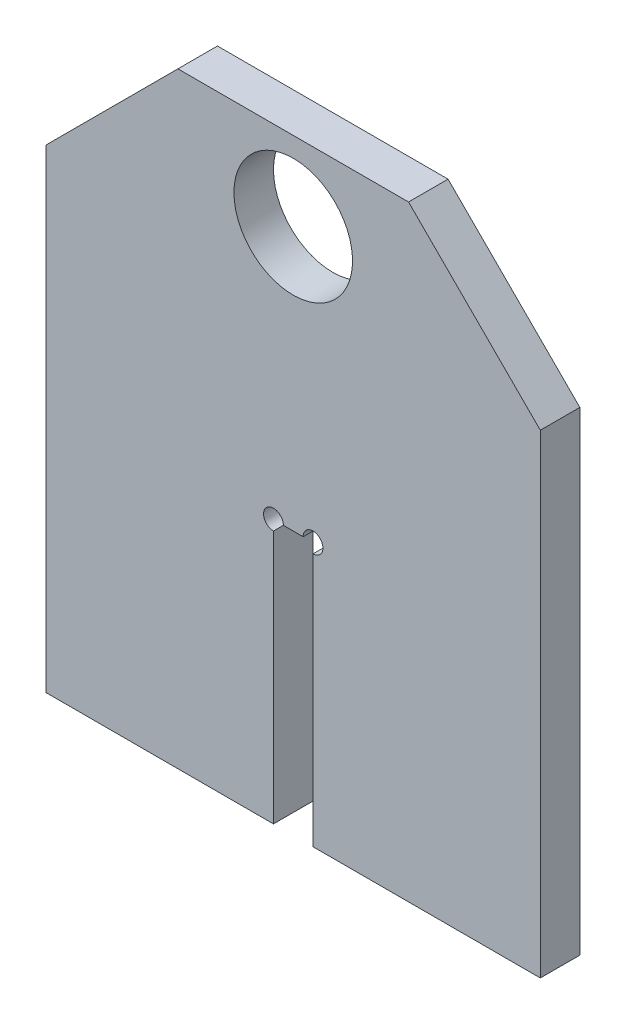
ISO-10303-21;
HEADER;
FILE_DESCRIPTION(('STEP AP214'),'2;1');
FILE_NAME('part.step','',(''),(''),'','','');
FILE_SCHEMA(('AUTOMOTIVE_DESIGN { 1 0 10303 214 1 1 1 1 }'));
ENDSEC;
DATA;
#1=APPLICATION_CONTEXT('core data for automotive mechanical design processes');
#2=APPLICATION_PROTOCOL_DEFINITION('international standard','automotive_design',2000,#1);
#3=PRODUCT_CONTEXT('',#1,'mechanical');
#4=PRODUCT('Part','Part','',(#3));
#5=PRODUCT_RELATED_PRODUCT_CATEGORY('part','',(#4));
#6=PRODUCT_DEFINITION_FORMATION('','',#4);
#7=PRODUCT_DEFINITION_CONTEXT('part definition',#1,'design');
#8=PRODUCT_DEFINITION('design','',#6,#7);
#9=PRODUCT_DEFINITION_SHAPE('','',#8);
#10=(LENGTH_UNIT() NAMED_UNIT(*) SI_UNIT(.MILLI.,.METRE.));
#11=(NAMED_UNIT(*) PLANE_ANGLE_UNIT() SI_UNIT($,.RADIAN.));
#12=(NAMED_UNIT(*) SI_UNIT($,.STERADIAN.) SOLID_ANGLE_UNIT());
#13=UNCERTAINTY_MEASURE_WITH_UNIT(LENGTH_MEASURE(1.E-05),#10,'distance_accuracy_value','');
#14=(GEOMETRIC_REPRESENTATION_CONTEXT(3) GLOBAL_UNCERTAINTY_ASSIGNED_CONTEXT((#13)) GLOBAL_UNIT_ASSIGNED_CONTEXT((#10,
#11,#12)) REPRESENTATION_CONTEXT('',''));
#15=CARTESIAN_POINT('',(0.,0.,0.));
#16=DIRECTION('',(0.,0.,1.));
#17=DIRECTION('',(1.,0.,0.));
#18=AXIS2_PLACEMENT_3D('',#15,#16,#17);
#19=CARTESIAN_POINT('',(9.64995892933224E-05,239.99993796999,124.697113534619));
#20=DIRECTION('',(0.,0.,-1.00000000000002));
#21=DIRECTION('',(-0.999999999999985,0.,0.));
#22=AXIS2_PLACEMENT_3D('',#19,#20,#21);
#23=CYLINDRICAL_SURFACE('',#22,9.00000000000002);
#24=CARTESIAN_POINT('',(9.64995893713849E-05,239.99993796999,5.99999999999998));
#25=DIRECTION('',(0.,0.,-1.00000000000001));
#26=DIRECTION('',(-0.999999999999985,0.,0.));
#27=AXIS2_PLACEMENT_3D('',#24,#25,#26);
#28=CIRCLE('',#27,9.00000000000002);
#29=CARTESIAN_POINT('',(-8.99990350041051,239.99993796999,5.99999999999998));
#30=VERTEX_POINT('',#29);
#31=EDGE_CURVE('E11',#30,#30,#28,.T.);
#32=ORIENTED_EDGE('',*,*,#31,.F.);
#33=EDGE_LOOP('',(#32));
#34=FACE_BOUND('',#33,.T.);
#35=CARTESIAN_POINT('',(9.64995893609766E-05,239.99993796999,0.));
#36=DIRECTION('',(0.,0.,1.00000000000002));
#37=DIRECTION('',(0.999999999999985,0.,0.));
#38=AXIS2_PLACEMENT_3D('',#35,#36,#37);
#39=CIRCLE('',#38,9.00000000000002);
#40=CARTESIAN_POINT('',(9.00009649958924,239.99993796999,0.));
#41=VERTEX_POINT('',#40);
#42=EDGE_CURVE('E157',#41,#41,#39,.T.);
#43=ORIENTED_EDGE('',*,*,#42,.F.);
#44=EDGE_LOOP('',(#43));
#45=FACE_BOUND('',#44,.T.);
#46=ADVANCED_FACE('F38',(#34,#45),#23,.F.);
#47=CARTESIAN_POINT('',(0.,0.,0.));
#48=DIRECTION('',(0.,0.,1.00000000000002));
#49=DIRECTION('',(0.999999999999985,0.,0.));
#50=AXIS2_PLACEMENT_3D('',#47,#48,#49);
#51=PLANE('',#50);
#52=ORIENTED_EDGE('',*,*,#42,.T.);
#53=EDGE_LOOP('',(#52));
#54=FACE_BOUND('',#53,.T.);
#55=CARTESIAN_POINT('',(3.00000000001347,200.,0.));
#56=DIRECTION('',(0.,0.,1.00000000000002));
#57=DIRECTION('',(0.999999999999985,0.,0.));
#58=AXIS2_PLACEMENT_3D('',#55,#56,#57);
#59=CIRCLE('',#58,1.5);
#60=CARTESIAN_POINT('',(3.00000000001348,198.5,0.));
#61=VERTEX_POINT('',#60);
#62=CARTESIAN_POINT('',(1.50000000001349,200.,0.));
#63=VERTEX_POINT('',#62);
#64=EDGE_CURVE('E146',#61,#63,#59,.T.);
#65=ORIENTED_EDGE('',*,*,#64,.T.);
#66=DIRECTION('',(0.999999999999985,0.,0.));
#67=VECTOR('',#66,1.);
#68=CARTESIAN_POINT('',(0.,200.,0.));
#69=LINE('',#68,#67);
#70=CARTESIAN_POINT('',(-1.49999999998635,200.,0.));
#71=VERTEX_POINT('',#70);
#72=EDGE_CURVE('E197',#71,#63,#69,.T.);
#73=ORIENTED_EDGE('',*,*,#72,.F.);
#74=CARTESIAN_POINT('',(-2.99999999998636,200.,0.));
#75=DIRECTION('',(0.,0.,1.00000000000002));
#76=DIRECTION('',(0.999999999999985,0.,0.));
#77=AXIS2_PLACEMENT_3D('',#74,#75,#76);
#78=CIRCLE('',#77,1.5);
#79=CARTESIAN_POINT('',(-2.99999999998638,198.5,0.));
#80=VERTEX_POINT('',#79);
#81=EDGE_CURVE('E193',#71,#80,#78,.T.);
#82=ORIENTED_EDGE('',*,*,#81,.T.);
#83=DIRECTION('',(0.,1.,0.));
#84=VECTOR('',#83,1.);
#85=CARTESIAN_POINT('',(-2.99999999998752,0.,0.));
#86=LINE('',#85,#84);
#87=CARTESIAN_POINT('',(-2.99999999998662,160.,0.));
#88=VERTEX_POINT('',#87);
#89=EDGE_CURVE('E189',#88,#80,#86,.T.);
#90=ORIENTED_EDGE('',*,*,#89,.F.);
#91=DIRECTION('',(0.999999999999985,0.,0.));
#92=VECTOR('',#91,1.);
#93=CARTESIAN_POINT('',(-1.35308431126191E-13,160.,0.));
#94=LINE('',#93,#92);
#95=CARTESIAN_POINT('',(-37.4999999999995,160.,0.));
#96=VERTEX_POINT('',#95);
#97=EDGE_CURVE('E185',#96,#88,#94,.T.);
#98=ORIENTED_EDGE('',*,*,#97,.F.);
#99=DIRECTION('',(0.,1.,0.));
#100=VECTOR('',#99,1.);
#101=CARTESIAN_POINT('',(-37.4999999999995,0.,0.));
#102=LINE('',#101,#100);
#103=CARTESIAN_POINT('',(-37.4999999999994,232.000025877441,0.));
#104=VERTEX_POINT('',#103);
#105=EDGE_CURVE('E182',#96,#104,#102,.T.);
#106=ORIENTED_EDGE('',*,*,#105,.T.);
#107=DIRECTION('',(-0.707106781186536,-0.707106781186547,0.));
#108=VECTOR('',#107,1.);
#109=CARTESIAN_POINT('',(-134.750012938718,134.750012938724,2.56739074444567E-13));
#110=LINE('',#109,#108);
#111=CARTESIAN_POINT('',(-17.4999999999997,252.000025877441,0.));
#112=VERTEX_POINT('',#111);
#113=EDGE_CURVE('E178',#112,#104,#110,.T.);
#114=ORIENTED_EDGE('',*,*,#113,.F.);
#115=DIRECTION('',(-0.999999999999985,0.,0.));
#116=VECTOR('',#115,1.);
#117=CARTESIAN_POINT('',(0.,252.000025877441,0.));
#118=LINE('',#117,#116);
#119=CARTESIAN_POINT('',(17.4999999999997,252.000025877441,0.));
#120=VERTEX_POINT('',#119);
#121=EDGE_CURVE('E174',#120,#112,#118,.T.);
#122=ORIENTED_EDGE('',*,*,#121,.F.);
#123=DIRECTION('',(-0.707106781186539,0.707106781186547,0.));
#124=VECTOR('',#123,1.);
#125=CARTESIAN_POINT('',(134.750012938719,134.750012938718,-1.04083408558608E-13));
#126=LINE('',#125,#124);
#127=CARTESIAN_POINT('',(37.4999999999995,232.000025877441,0.));
#128=VERTEX_POINT('',#127);
#129=EDGE_CURVE('E170',#128,#120,#126,.T.);
#130=ORIENTED_EDGE('',*,*,#129,.F.);
#131=DIRECTION('',(0.,1.,0.));
#132=VECTOR('',#131,1.);
#133=CARTESIAN_POINT('',(37.4999999999993,0.,0.));
#134=LINE('',#133,#132);
#135=CARTESIAN_POINT('',(37.4999999999993,160.,0.));
#136=VERTEX_POINT('',#135);
#137=EDGE_CURVE('E166',#136,#128,#134,.T.);
#138=ORIENTED_EDGE('',*,*,#137,.F.);
#139=DIRECTION('',(0.999999999999985,0.,0.));
#140=VECTOR('',#139,1.);
#141=CARTESIAN_POINT('',(1.30104260698261E-13,160.,0.));
#142=LINE('',#141,#140);
#143=CARTESIAN_POINT('',(3.00000000001333,160.,0.));
#144=VERTEX_POINT('',#143);
#145=EDGE_CURVE('E149',#144,#136,#142,.T.);
#146=ORIENTED_EDGE('',*,*,#145,.F.);
#147=DIRECTION('',(0.,-1.,0.));
#148=VECTOR('',#147,1.);
#149=CARTESIAN_POINT('',(3.00000000001282,0.,0.));
#150=LINE('',#149,#148);
#151=EDGE_CURVE('E136',#61,#144,#150,.T.);
#152=ORIENTED_EDGE('',*,*,#151,.F.);
#153=EDGE_LOOP('',(#65,#73,#82,#90,#98,#106,#114,#122,#130,#138,#146,#152));
#154=FACE_BOUND('',#153,.T.);
#155=ADVANCED_FACE('F144',(#54,#154),#51,.F.);
#156=CARTESIAN_POINT('',(0.,200.,124.697113534619));
#157=DIRECTION('',(0.,1.,0.));
#158=DIRECTION('',(0.,0.,1.00000000000002));
#159=AXIS2_PLACEMENT_3D('',#156,#157,#158);
#160=PLANE('',#159);
#161=DIRECTION('',(0.,0.,-1.00000000000002));
#162=VECTOR('',#161,1.);
#163=CARTESIAN_POINT('',(1.50000000001341,200.,124.697113534619));
#164=LINE('',#163,#162);
#165=CARTESIAN_POINT('',(1.50000000001348,200.,5.99999999999988));
#166=VERTEX_POINT('',#165);
#167=EDGE_CURVE('E154',#166,#63,#164,.T.);
#168=ORIENTED_EDGE('',*,*,#167,.F.);
#169=DIRECTION('',(-0.999999999999985,0.,0.));
#170=VECTOR('',#169,1.);
#171=CARTESIAN_POINT('',(0.,200.,5.99999999999995));
#172=LINE('',#171,#170);
#173=CARTESIAN_POINT('',(-1.49999999998636,200.,5.99999999999996));
#174=VERTEX_POINT('',#173);
#175=EDGE_CURVE('E41',#166,#174,#172,.T.);
#176=ORIENTED_EDGE('',*,*,#175,.T.);
#177=DIRECTION('',(0.,0.,-1.00000000000002));
#178=VECTOR('',#177,1.);
#179=CARTESIAN_POINT('',(-1.49999999998633,200.,124.697113534619));
#180=LINE('',#179,#178);
#181=EDGE_CURVE('E202',#174,#71,#180,.T.);
#182=ORIENTED_EDGE('',*,*,#181,.T.);
#183=ORIENTED_EDGE('',*,*,#72,.T.);
#184=EDGE_LOOP('',(#168,#176,#182,#183));
#185=FACE_BOUND('',#184,.T.);
#186=ADVANCED_FACE('F301',(#185),#160,.F.);
#187=CARTESIAN_POINT('',(-2.99999999998644,200.,124.697113534619));
#188=DIRECTION('',(0.,0.,-1.00000000000002));
#189=DIRECTION('',(-0.999999999999985,0.,0.));
#190=AXIS2_PLACEMENT_3D('',#187,#188,#189);
#191=CYLINDRICAL_SURFACE('',#190,1.5);
#192=CARTESIAN_POINT('',(-2.99999999998634,200.,5.99999999999996));
#193=DIRECTION('',(0.,0.,-1.00000000000001));
#194=DIRECTION('',(-0.999999999999985,0.,0.));
#195=AXIS2_PLACEMENT_3D('',#192,#193,#194);
#196=CIRCLE('',#195,1.5);
#197=CARTESIAN_POINT('',(-2.99999999998634,198.5,5.99999999999995));
#198=VERTEX_POINT('',#197);
#199=EDGE_CURVE('E94',#198,#174,#196,.T.);
#200=ORIENTED_EDGE('',*,*,#199,.F.);
#201=DIRECTION('',(0.,0.,-1.00000000000002));
#202=VECTOR('',#201,1.);
#203=CARTESIAN_POINT('',(-2.99999999998644,198.5,124.697113534619));
#204=LINE('',#203,#202);
#205=EDGE_CURVE('E205',#198,#80,#204,.T.);
#206=ORIENTED_EDGE('',*,*,#205,.T.);
#207=ORIENTED_EDGE('',*,*,#81,.F.);
#208=ORIENTED_EDGE('',*,*,#181,.F.);
#209=EDGE_LOOP('',(#200,#206,#207,#208));
#210=FACE_BOUND('',#209,.T.);
#211=ADVANCED_FACE('F299',(#210),#191,.F.);
#212=CARTESIAN_POINT('',(-2.99999999998754,0.,124.697113534619));
#213=DIRECTION('',(-0.999999999999985,0.,0.));
#214=DIRECTION('',(0.,-1.,0.));
#215=AXIS2_PLACEMENT_3D('',#212,#213,#214);
#216=PLANE('',#215);
#217=ORIENTED_EDGE('',*,*,#205,.F.);
#218=DIRECTION('',(0.,-1.,0.));
#219=VECTOR('',#218,1.);
#220=CARTESIAN_POINT('',(-2.99999999998745,0.,5.99999999999994));
#221=LINE('',#220,#219);
#222=CARTESIAN_POINT('',(-2.99999999998658,160.,5.99999999999994));
#223=VERTEX_POINT('',#222);
#224=EDGE_CURVE('E57',#198,#223,#221,.T.);
#225=ORIENTED_EDGE('',*,*,#224,.T.);
#226=DIRECTION('',(0.,0.,-1.00000000000002));
#227=VECTOR('',#226,1.);
#228=CARTESIAN_POINT('',(-2.99999999998666,160.,124.697113534619));
#229=LINE('',#228,#227);
#230=EDGE_CURVE('E208',#223,#88,#229,.T.);
#231=ORIENTED_EDGE('',*,*,#230,.T.);
#232=ORIENTED_EDGE('',*,*,#89,.T.);
#233=EDGE_LOOP('',(#217,#225,#231,#232));
#234=FACE_BOUND('',#233,.T.);
#235=ADVANCED_FACE('F296',(#234),#216,.F.);
#236=CARTESIAN_POINT('',(-2.48065457064683E-13,160.,124.697113534619));
#237=DIRECTION('',(0.,1.,0.));
#238=DIRECTION('',(-0.999999999999985,0.,0.));
#239=AXIS2_PLACEMENT_3D('',#236,#237,#238);
#240=PLANE('',#239);
#241=ORIENTED_EDGE('',*,*,#230,.F.);
#242=DIRECTION('',(-0.999999999999985,0.,0.));
#243=VECTOR('',#242,1.);
#244=CARTESIAN_POINT('',(-1.04083408558608E-13,160.,5.99999999999994));
#245=LINE('',#244,#243);
#246=CARTESIAN_POINT('',(-37.4999999999995,160.,5.99999999999993));
#247=VERTEX_POINT('',#246);
#248=EDGE_CURVE('E256',#223,#247,#245,.T.);
#249=ORIENTED_EDGE('',*,*,#248,.T.);
#250=DIRECTION('',(0.,0.,-1.00000000000002));
#251=VECTOR('',#250,1.);
#252=CARTESIAN_POINT('',(-37.4999999999996,160.,124.697113534619));
#253=LINE('',#252,#251);
#254=EDGE_CURVE('E211',#247,#96,#253,.T.);
#255=ORIENTED_EDGE('',*,*,#254,.T.);
#256=ORIENTED_EDGE('',*,*,#97,.T.);
#257=EDGE_LOOP('',(#241,#249,#255,#256));
#258=FACE_BOUND('',#257,.T.);
#259=ADVANCED_FACE('F293',(#258),#240,.F.);
#260=CARTESIAN_POINT('',(-37.4999999999997,0.,124.697113534619));
#261=DIRECTION('',(-0.999999999999985,0.,0.));
#262=DIRECTION('',(0.,-1.,0.));
#263=AXIS2_PLACEMENT_3D('',#260,#261,#262);
#264=PLANE('',#263);
#265=DIRECTION('',(0.,-1.,0.));
#266=VECTOR('',#265,1.);
#267=CARTESIAN_POINT('',(-37.4999999999996,0.,5.99999999999993));
#268=LINE('',#267,#266);
#269=CARTESIAN_POINT('',(-37.4999999999994,232.000025877441,6.));
#270=VERTEX_POINT('',#269);
#271=EDGE_CURVE('E249',#270,#247,#268,.T.);
#272=ORIENTED_EDGE('',*,*,#271,.F.);
#273=DIRECTION('',(0.,0.,-1.00000000000002));
#274=VECTOR('',#273,1.);
#275=CARTESIAN_POINT('',(-37.4999999999994,232.000025877441,124.697113534619));
#276=LINE('',#275,#274);
#277=EDGE_CURVE('E214',#270,#104,#276,.T.);
#278=ORIENTED_EDGE('',*,*,#277,.T.);
#279=ORIENTED_EDGE('',*,*,#105,.F.);
#280=ORIENTED_EDGE('',*,*,#254,.F.);
#281=EDGE_LOOP('',(#272,#278,#279,#280));
#282=FACE_BOUND('',#281,.T.);
#283=ADVANCED_FACE('F290',(#282),#264,.T.);
#284=CARTESIAN_POINT('',(-134.750012938719,134.750012938721,124.697113534619));
#285=DIRECTION('',(0.707106781186538,-0.707106781186548,0.));
#286=DIRECTION('',(0.707106781186536,0.707106781186547,0.));
#287=AXIS2_PLACEMENT_3D('',#284,#285,#286);
#288=PLANE('',#287);
#289=ORIENTED_EDGE('',*,*,#277,.F.);
#290=DIRECTION('',(0.707106781186537,0.707106781186547,0.));
#291=VECTOR('',#290,1.);
#292=CARTESIAN_POINT('',(-134.750012938718,134.750012938724,5.99999999999996));
#293=LINE('',#292,#291);
#294=CARTESIAN_POINT('',(-17.4999999999998,252.000025877441,5.99999999999994));
#295=VERTEX_POINT('',#294);
#296=EDGE_CURVE('E251',#270,#295,#293,.T.);
#297=ORIENTED_EDGE('',*,*,#296,.T.);
#298=DIRECTION('',(0.,0.,-1.00000000000002));
#299=VECTOR('',#298,1.);
#300=CARTESIAN_POINT('',(-17.5,252.000025877441,124.697113534619));
#301=LINE('',#300,#299);
#302=EDGE_CURVE('E217',#295,#112,#301,.T.);
#303=ORIENTED_EDGE('',*,*,#302,.T.);
#304=ORIENTED_EDGE('',*,*,#113,.T.);
#305=EDGE_LOOP('',(#289,#297,#303,#304));
#306=FACE_BOUND('',#305,.T.);
#307=ADVANCED_FACE('F284',(#306),#288,.F.);
#308=CARTESIAN_POINT('',(-1.09287578986539E-13,252.000025877441,124.697113534619));
#309=DIRECTION('',(0.,-1.,0.));
#310=DIRECTION('',(0.,0.,-1.00000000000002));
#311=AXIS2_PLACEMENT_3D('',#308,#309,#310);
#312=PLANE('',#311);
#313=ORIENTED_EDGE('',*,*,#302,.F.);
#314=DIRECTION('',(0.999999999999985,0.,0.));
#315=VECTOR('',#314,1.);
#316=CARTESIAN_POINT('',(0.,252.000025877441,5.99999999999998));
#317=LINE('',#316,#315);
#318=CARTESIAN_POINT('',(17.4999999999997,252.000025877441,6.00000000000005));
#319=VERTEX_POINT('',#318);
#320=EDGE_CURVE('E253',#295,#319,#317,.T.);
#321=ORIENTED_EDGE('',*,*,#320,.T.);
#322=DIRECTION('',(0.,0.,-1.00000000000002));
#323=VECTOR('',#322,1.);
#324=CARTESIAN_POINT('',(17.4999999999995,252.000025877441,124.697113534619));
#325=LINE('',#324,#323);
#326=EDGE_CURVE('E220',#319,#120,#325,.T.);
#327=ORIENTED_EDGE('',*,*,#326,.T.);
#328=ORIENTED_EDGE('',*,*,#121,.T.);
#329=EDGE_LOOP('',(#313,#321,#327,#328));
#330=FACE_BOUND('',#329,.T.);
#331=ADVANCED_FACE('F281',(#330),#312,.F.);
#332=CARTESIAN_POINT('',(134.750012938719,134.75001293872,124.697113534619));
#333=DIRECTION('',(-0.707106781186536,-0.707106781186548,0.));
#334=DIRECTION('',(0.707106781186539,-0.707106781186547,0.));
#335=AXIS2_PLACEMENT_3D('',#332,#333,#334);
#336=PLANE('',#335);
#337=ORIENTED_EDGE('',*,*,#326,.F.);
#338=DIRECTION('',(0.707106781186539,-0.707106781186547,0.));
#339=VECTOR('',#338,1.);
#340=CARTESIAN_POINT('',(134.750012938719,134.750012938718,5.9999999999999));
#341=LINE('',#340,#339);
#342=CARTESIAN_POINT('',(37.4999999999995,232.000025877441,6.00000000000002));
#343=VERTEX_POINT('',#342);
#344=EDGE_CURVE('E243',#319,#343,#341,.T.);
#345=ORIENTED_EDGE('',*,*,#344,.T.);
#346=DIRECTION('',(0.,0.,-1.00000000000002));
#347=VECTOR('',#346,1.);
#348=CARTESIAN_POINT('',(37.4999999999995,232.000025877441,124.697113534619));
#349=LINE('',#348,#347);
#350=EDGE_CURVE('E223',#343,#128,#349,.T.);
#351=ORIENTED_EDGE('',*,*,#350,.T.);
#352=ORIENTED_EDGE('',*,*,#129,.T.);
#353=EDGE_LOOP('',(#337,#345,#351,#352));
#354=FACE_BOUND('',#353,.T.);
#355=ADVANCED_FACE('F271',(#354),#336,.F.);
#356=CARTESIAN_POINT('',(37.4999999999996,0.,124.697113534619));
#357=DIRECTION('',(-0.999999999999985,0.,0.));
#358=DIRECTION('',(0.,-1.,0.));
#359=AXIS2_PLACEMENT_3D('',#356,#357,#358);
#360=PLANE('',#359);
#361=ORIENTED_EDGE('',*,*,#350,.F.);
#362=DIRECTION('',(0.,-1.,0.));
#363=VECTOR('',#362,1.);
#364=CARTESIAN_POINT('',(37.4999999999993,0.,6.00000000000004));
#365=LINE('',#364,#363);
#366=CARTESIAN_POINT('',(37.4999999999993,160.,6.00000000000001));
#367=VERTEX_POINT('',#366);
#368=EDGE_CURVE('E238',#343,#367,#365,.T.);
#369=ORIENTED_EDGE('',*,*,#368,.T.);
#370=DIRECTION('',(0.,0.,-1.00000000000002));
#371=VECTOR('',#370,1.);
#372=CARTESIAN_POINT('',(37.4999999999996,160.,124.697113534619));
#373=LINE('',#372,#371);
#374=EDGE_CURVE('E226',#367,#136,#373,.T.);
#375=ORIENTED_EDGE('',*,*,#374,.T.);
#376=ORIENTED_EDGE('',*,*,#137,.T.);
#377=EDGE_LOOP('',(#361,#369,#375,#376));
#378=FACE_BOUND('',#377,.T.);
#379=ADVANCED_FACE('F277',(#378),#360,.F.);
#380=CARTESIAN_POINT('',(0.,160.,124.697113534619));
#381=DIRECTION('',(0.,1.,0.));
#382=DIRECTION('',(-0.999999999999985,0.,0.));
#383=AXIS2_PLACEMENT_3D('',#380,#381,#382);
#384=PLANE('',#383);
#385=ORIENTED_EDGE('',*,*,#374,.F.);
#386=DIRECTION('',(-0.999999999999985,0.,0.));
#387=VECTOR('',#386,1.);
#388=CARTESIAN_POINT('',(1.56125112837913E-13,160.,5.99999999999994));
#389=LINE('',#388,#387);
#390=CARTESIAN_POINT('',(3.0000000000133,160.,5.99999999999994));
#391=VERTEX_POINT('',#390);
#392=EDGE_CURVE('E235',#367,#391,#389,.T.);
#393=ORIENTED_EDGE('',*,*,#392,.T.);
#394=DIRECTION('',(0.,0.,-1.00000000000002));
#395=VECTOR('',#394,1.);
#396=CARTESIAN_POINT('',(3.00000000001313,160.,124.697113534619));
#397=LINE('',#396,#395);
#398=EDGE_CURVE('E140',#391,#144,#397,.T.);
#399=ORIENTED_EDGE('',*,*,#398,.T.);
#400=ORIENTED_EDGE('',*,*,#145,.T.);
#401=EDGE_LOOP('',(#385,#393,#399,#400));
#402=FACE_BOUND('',#401,.T.);
#403=ADVANCED_FACE('F234',(#402),#384,.F.);
#404=CARTESIAN_POINT('',(3.00000000001276,0.,124.697113534619));
#405=DIRECTION('',(0.999999999999985,0.,0.));
#406=DIRECTION('',(0.,1.,0.));
#407=AXIS2_PLACEMENT_3D('',#404,#405,#406);
#408=PLANE('',#407);
#409=ORIENTED_EDGE('',*,*,#398,.F.);
#410=DIRECTION('',(0.,1.,0.));
#411=VECTOR('',#410,1.);
#412=CARTESIAN_POINT('',(3.00000000001281,0.,5.99999999999987));
#413=LINE('',#412,#411);
#414=CARTESIAN_POINT('',(3.00000000001346,198.5,5.99999999999998));
#415=VERTEX_POINT('',#414);
#416=EDGE_CURVE('E85',#391,#415,#413,.T.);
#417=ORIENTED_EDGE('',*,*,#416,.T.);
#418=DIRECTION('',(0.,0.,-1.00000000000002));
#419=VECTOR('',#418,1.);
#420=CARTESIAN_POINT('',(3.00000000001335,198.5,124.697113534619));
#421=LINE('',#420,#419);
#422=EDGE_CURVE('E133',#415,#61,#421,.T.);
#423=ORIENTED_EDGE('',*,*,#422,.T.);
#424=ORIENTED_EDGE('',*,*,#151,.T.);
#425=EDGE_LOOP('',(#409,#417,#423,#424));
#426=FACE_BOUND('',#425,.T.);
#427=ADVANCED_FACE('F135',(#426),#408,.F.);
#428=CARTESIAN_POINT('',(3.00000000001337,200.,124.697113534619));
#429=DIRECTION('',(0.,0.,-1.00000000000002));
#430=DIRECTION('',(-0.999999999999985,0.,0.));
#431=AXIS2_PLACEMENT_3D('',#428,#429,#430);
#432=CYLINDRICAL_SURFACE('',#431,1.5);
#433=CARTESIAN_POINT('',(3.00000000001348,200.,5.99999999999998));
#434=DIRECTION('',(0.,0.,-1.00000000000001));
#435=DIRECTION('',(-0.999999999999985,0.,0.));
#436=AXIS2_PLACEMENT_3D('',#433,#434,#435);
#437=CIRCLE('',#436,1.5);
#438=EDGE_CURVE('E48',#166,#415,#437,.T.);
#439=ORIENTED_EDGE('',*,*,#438,.F.);
#440=ORIENTED_EDGE('',*,*,#167,.T.);
#441=ORIENTED_EDGE('',*,*,#64,.F.);
#442=ORIENTED_EDGE('',*,*,#422,.F.);
#443=EDGE_LOOP('',(#439,#440,#441,#442));
#444=FACE_BOUND('',#443,.T.);
#445=ADVANCED_FACE('F152',(#444),#432,.F.);
#446=CARTESIAN_POINT('',(-855.599205235686,-1.11022302462516E-13,5.99999999999823));
#447=DIRECTION('',(0.,0.,-1.00000000000001));
#448=DIRECTION('',(-0.999999999999985,0.,0.));
#449=AXIS2_PLACEMENT_3D('',#446,#447,#448);
#450=PLANE('',#449);
#451=ORIENTED_EDGE('',*,*,#31,.T.);
#452=EDGE_LOOP('',(#451));
#453=FACE_BOUND('',#452,.T.);
#454=ORIENTED_EDGE('',*,*,#438,.T.);
#455=ORIENTED_EDGE('',*,*,#416,.F.);
#456=ORIENTED_EDGE('',*,*,#392,.F.);
#457=ORIENTED_EDGE('',*,*,#368,.F.);
#458=ORIENTED_EDGE('',*,*,#344,.F.);
#459=ORIENTED_EDGE('',*,*,#320,.F.);
#460=ORIENTED_EDGE('',*,*,#296,.F.);
#461=ORIENTED_EDGE('',*,*,#271,.T.);
#462=ORIENTED_EDGE('',*,*,#248,.F.);
#463=ORIENTED_EDGE('',*,*,#224,.F.);
#464=ORIENTED_EDGE('',*,*,#199,.T.);
#465=ORIENTED_EDGE('',*,*,#175,.F.);
#466=EDGE_LOOP('',(#454,#455,#456,#457,#458,#459,#460,#461,#462,#463,#464,#465));
#467=FACE_BOUND('',#466,.T.);
#468=ADVANCED_FACE('F274',(#453,#467),#450,.F.);
#469=CLOSED_SHELL('',(#46,#155,#186,#211,#235,#259,#283,#307,#331,#355,#379,#403,#427,#445,#468));
#470=MANIFOLD_SOLID_BREP('B2',#469);
#471=ADVANCED_BREP_SHAPE_REPRESENTATION('',(#18,#470),#14);
#472=SHAPE_DEFINITION_REPRESENTATION(#9,#471);
ENDSEC;
END-ISO-10303-21;
